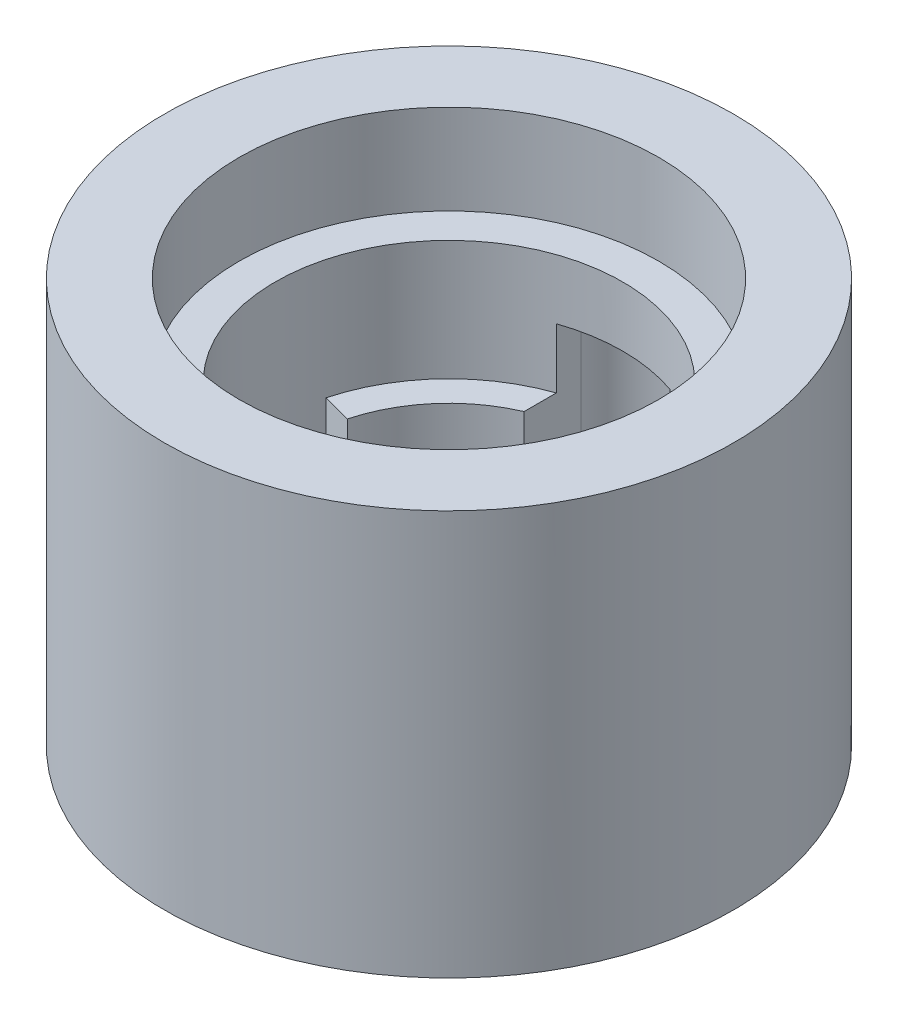
ISO-10303-21;
HEADER;
FILE_DESCRIPTION(('STEP AP214'),'2;1');
FILE_NAME('part.step','',(''),(''),'','','');
FILE_SCHEMA(('AUTOMOTIVE_DESIGN { 1 0 10303 214 1 1 1 1 }'));
ENDSEC;
DATA;
#1=APPLICATION_CONTEXT('core data for automotive mechanical design processes');
#2=APPLICATION_PROTOCOL_DEFINITION('international standard','automotive_design',2000,#1);
#3=PRODUCT_CONTEXT('',#1,'mechanical');
#4=PRODUCT('Part','Part','',(#3));
#5=PRODUCT_RELATED_PRODUCT_CATEGORY('part','',(#4));
#6=PRODUCT_DEFINITION_FORMATION('','',#4);
#7=PRODUCT_DEFINITION_CONTEXT('part definition',#1,'design');
#8=PRODUCT_DEFINITION('design','',#6,#7);
#9=PRODUCT_DEFINITION_SHAPE('','',#8);
#10=(LENGTH_UNIT() NAMED_UNIT(*) SI_UNIT(.MILLI.,.METRE.));
#11=(NAMED_UNIT(*) PLANE_ANGLE_UNIT() SI_UNIT($,.RADIAN.));
#12=(NAMED_UNIT(*) SI_UNIT($,.STERADIAN.) SOLID_ANGLE_UNIT());
#13=UNCERTAINTY_MEASURE_WITH_UNIT(LENGTH_MEASURE(1.E-05),#10,'distance_accuracy_value','');
#14=(GEOMETRIC_REPRESENTATION_CONTEXT(3) GLOBAL_UNCERTAINTY_ASSIGNED_CONTEXT((#13)) GLOBAL_UNIT_ASSIGNED_CONTEXT((#10,
#11,#12)) REPRESENTATION_CONTEXT('',''));
#15=CARTESIAN_POINT('',(0.,0.,0.));
#16=DIRECTION('',(0.,0.,1.));
#17=DIRECTION('',(1.,0.,0.));
#18=AXIS2_PLACEMENT_3D('',#15,#16,#17);
#19=CARTESIAN_POINT('',(0.,10.16,0.));
#20=DIRECTION('',(0.,-1.,0.));
#21=DIRECTION('',(0.,0.,-1.));
#22=AXIS2_PLACEMENT_3D('',#19,#20,#21);
#23=CYLINDRICAL_SURFACE('',#22,6.096);
#24=DIRECTION('',(0.,-1.,0.));
#25=VECTOR('',#24,1.);
#26=CARTESIAN_POINT('',(-5.88828383705816,10.16,1.57776089894497));
#27=LINE('',#26,#25);
#28=CARTESIAN_POINT('',(-5.88828383705816,5.08,1.57776089894497));
#29=VERTEX_POINT('',#28);
#30=CARTESIAN_POINT('',(-5.88828383705816,-3.175,1.57776089894497));
#31=VERTEX_POINT('',#30);
#32=EDGE_CURVE('E126',#29,#31,#27,.T.);
#33=ORIENTED_EDGE('',*,*,#32,.F.);
#34=CARTESIAN_POINT('',(0.,5.08,0.));
#35=DIRECTION('',(0.,1.,0.));
#36=DIRECTION('',(0.,0.,1.));
#37=AXIS2_PLACEMENT_3D('',#34,#35,#36);
#38=CIRCLE('',#37,6.096);
#39=CARTESIAN_POINT('',(2.413,5.08,-5.59809315749569));
#40=VERTEX_POINT('',#39);
#41=EDGE_CURVE('E152',#29,#40,#38,.T.);
#42=ORIENTED_EDGE('',*,*,#41,.T.);
#43=DIRECTION('',(0.,-1.,0.));
#44=VECTOR('',#43,1.);
#45=CARTESIAN_POINT('',(2.413,10.16,-5.59809315749568));
#46=LINE('',#45,#44);
#47=CARTESIAN_POINT('',(2.413,-3.175,-5.59809315749569));
#48=VERTEX_POINT('',#47);
#49=EDGE_CURVE('E197',#48,#40,#46,.F.);
#50=ORIENTED_EDGE('',*,*,#49,.F.);
#51=CARTESIAN_POINT('',(0.,-3.175,0.));
#52=DIRECTION('',(0.,-1.,0.));
#53=DIRECTION('',(0.,0.,1.));
#54=AXIS2_PLACEMENT_3D('',#51,#52,#53);
#55=CIRCLE('',#54,6.096);
#56=EDGE_CURVE('E171',#48,#31,#55,.T.);
#57=ORIENTED_EDGE('',*,*,#56,.T.);
#58=EDGE_LOOP('',(#33,#42,#50,#57));
#59=FACE_BOUND('',#58,.T.);
#60=ADVANCED_FACE('F38',(#59),#23,.F.);
#61=CARTESIAN_POINT('',(0.,5.08,0.));
#62=DIRECTION('',(0.,1.,0.));
#63=DIRECTION('',(0.,0.,1.));
#64=AXIS2_PLACEMENT_3D('',#61,#62,#63);
#65=PLANE('',#64);
#66=DIRECTION('',(0.965925826289068,0.,-0.258819045102522));
#67=VECTOR('',#66,1.);
#68=CARTESIAN_POINT('',(0.,5.08,0.));
#69=LINE('',#68,#67);
#70=CARTESIAN_POINT('',(-7.11500963644528,5.08,1.90646108622517));
#71=VERTEX_POINT('',#70);
#72=EDGE_CURVE('E143',#71,#29,#69,.T.);
#73=ORIENTED_EDGE('',*,*,#72,.F.);
#74=CARTESIAN_POINT('',(0.,5.08,0.));
#75=DIRECTION('',(0.,1.,0.));
#76=DIRECTION('',(0.,0.,1.));
#77=AXIS2_PLACEMENT_3D('',#74,#75,#76);
#78=CIRCLE('',#77,7.366);
#79=CARTESIAN_POINT('',(2.413,5.08,-6.95955364948069));
#80=VERTEX_POINT('',#79);
#81=EDGE_CURVE('E60',#71,#80,#78,.T.);
#82=ORIENTED_EDGE('',*,*,#81,.T.);
#83=DIRECTION('',(0.,0.,1.));
#84=VECTOR('',#83,1.);
#85=CARTESIAN_POINT('',(2.413,5.08,0.));
#86=LINE('',#85,#84);
#87=EDGE_CURVE('E220',#80,#40,#86,.T.);
#88=ORIENTED_EDGE('',*,*,#87,.T.);
#89=ORIENTED_EDGE('',*,*,#41,.F.);
#90=EDGE_LOOP('',(#73,#82,#88,#89));
#91=FACE_BOUND('',#90,.T.);
#92=ADVANCED_FACE('F256',(#91),#65,.T.);
#93=DIRECTION('',(0.,-1.,0.));
#94=VECTOR('',#93,1.);
#95=CARTESIAN_POINT('',(-5.88828383705816,10.16,-1.57776089894497));
#96=LINE('',#95,#94);
#97=CARTESIAN_POINT('',(-5.88828383705816,-3.175,-1.57776089894497));
#98=VERTEX_POINT('',#97);
#99=CARTESIAN_POINT('',(-5.88828383705816,5.08,-1.57776089894497));
#100=VERTEX_POINT('',#99);
#101=EDGE_CURVE('E52',#98,#100,#96,.F.);
#102=ORIENTED_EDGE('',*,*,#101,.F.);
#103=CARTESIAN_POINT('',(-2.413,-3.175,-5.59809315749569));
#104=VERTEX_POINT('',#103);
#105=EDGE_CURVE('E170',#98,#104,#55,.T.);
#106=ORIENTED_EDGE('',*,*,#105,.T.);
#107=DIRECTION('',(0.,-1.,0.));
#108=VECTOR('',#107,1.);
#109=CARTESIAN_POINT('',(-2.413,10.16,-5.59809315749569));
#110=LINE('',#109,#108);
#111=CARTESIAN_POINT('',(-2.413,5.08,-5.59809315749569));
#112=VERTEX_POINT('',#111);
#113=EDGE_CURVE('E208',#112,#104,#110,.T.);
#114=ORIENTED_EDGE('',*,*,#113,.F.);
#115=EDGE_CURVE('E153',#112,#100,#38,.T.);
#116=ORIENTED_EDGE('',*,*,#115,.T.);
#117=EDGE_LOOP('',(#102,#106,#114,#116));
#118=FACE_BOUND('',#117,.T.);
#119=ADVANCED_FACE('F40',(#118),#23,.F.);
#120=CARTESIAN_POINT('',(2.413,19.5037827992735,-8.001));
#121=DIRECTION('',(0.,0.,-1.));
#122=DIRECTION('',(-1.,0.,0.));
#123=AXIS2_PLACEMENT_3D('',#120,#121,#122);
#124=PLANE('',#123);
#125=DIRECTION('',(-1.,0.,0.));
#126=VECTOR('',#125,1.);
#127=CARTESIAN_POINT('',(2.413,2.54,-8.001));
#128=LINE('',#127,#126);
#129=CARTESIAN_POINT('',(2.413,2.54,-8.001));
#130=VERTEX_POINT('',#129);
#131=CARTESIAN_POINT('',(-2.413,2.54,-8.001));
#132=VERTEX_POINT('',#131);
#133=EDGE_CURVE('E188',#130,#132,#128,.T.);
#134=ORIENTED_EDGE('',*,*,#133,.T.);
#135=DIRECTION('',(0.,-1.,0.));
#136=VECTOR('',#135,1.);
#137=CARTESIAN_POINT('',(-2.413,19.5037827992735,-8.001));
#138=LINE('',#137,#136);
#139=CARTESIAN_POINT('',(-2.413,-3.175,-8.001));
#140=VERTEX_POINT('',#139);
#141=EDGE_CURVE('E200',#132,#140,#138,.T.);
#142=ORIENTED_EDGE('',*,*,#141,.T.);
#143=DIRECTION('',(1.,0.,0.));
#144=VECTOR('',#143,1.);
#145=CARTESIAN_POINT('',(2.413,-3.175,-8.001));
#146=LINE('',#145,#144);
#147=CARTESIAN_POINT('',(2.413,-3.175,-8.001));
#148=VERTEX_POINT('',#147);
#149=EDGE_CURVE('E176',#140,#148,#146,.T.);
#150=ORIENTED_EDGE('',*,*,#149,.T.);
#151=DIRECTION('',(0.,-1.,0.));
#152=VECTOR('',#151,1.);
#153=CARTESIAN_POINT('',(2.413,19.5037827992735,-8.001));
#154=LINE('',#153,#152);
#155=EDGE_CURVE('E203',#130,#148,#154,.T.);
#156=ORIENTED_EDGE('',*,*,#155,.F.);
#157=EDGE_LOOP('',(#134,#142,#150,#156));
#158=FACE_BOUND('',#157,.T.);
#159=ADVANCED_FACE('F240',(#158),#124,.F.);
#160=CARTESIAN_POINT('',(0.,10.16,0.));
#161=DIRECTION('',(0.,1.,0.));
#162=DIRECTION('',(0.,0.,1.));
#163=AXIS2_PLACEMENT_3D('',#160,#161,#162);
#164=PLANE('',#163);
#165=CARTESIAN_POINT('',(0.,10.16,0.));
#166=DIRECTION('',(0.,1.,0.));
#167=DIRECTION('',(0.,0.,1.));
#168=AXIS2_PLACEMENT_3D('',#165,#166,#167);
#169=CIRCLE('',#168,7.366);
#170=CARTESIAN_POINT('',(0.,10.16,7.366));
#171=VERTEX_POINT('',#170);
#172=EDGE_CURVE('E156',#171,#171,#169,.T.);
#173=ORIENTED_EDGE('',*,*,#172,.F.);
#174=EDGE_LOOP('',(#173));
#175=FACE_BOUND('',#174,.T.);
#176=CARTESIAN_POINT('',(0.,10.16,0.));
#177=DIRECTION('',(0.,1.,0.));
#178=DIRECTION('',(0.,0.,1.));
#179=AXIS2_PLACEMENT_3D('',#176,#177,#178);
#180=CIRCLE('',#179,8.89);
#181=CARTESIAN_POINT('',(0.,10.16,8.89));
#182=VERTEX_POINT('',#181);
#183=EDGE_CURVE('E212',#182,#182,#180,.F.);
#184=ORIENTED_EDGE('',*,*,#183,.F.);
#185=EDGE_LOOP('',(#184));
#186=FACE_BOUND('',#185,.T.);
#187=ADVANCED_FACE('F269',(#175,#186),#164,.T.);
#188=CARTESIAN_POINT('',(0.,12.7,0.));
#189=DIRECTION('',(0.,-1.,0.));
#190=DIRECTION('',(0.,0.,-1.));
#191=AXIS2_PLACEMENT_3D('',#188,#189,#190);
#192=CYLINDRICAL_SURFACE('',#191,12.065);
#193=CARTESIAN_POINT('',(0.,13.97,0.));
#194=DIRECTION('',(0.,1.,0.));
#195=DIRECTION('',(0.,0.,1.));
#196=AXIS2_PLACEMENT_3D('',#193,#194,#195);
#197=CIRCLE('',#196,12.065);
#198=CARTESIAN_POINT('',(0.,13.97,12.065));
#199=VERTEX_POINT('',#198);
#200=EDGE_CURVE('E215',#199,#199,#197,.T.);
#201=ORIENTED_EDGE('',*,*,#200,.F.);
#202=EDGE_LOOP('',(#201));
#203=FACE_BOUND('',#202,.T.);
#204=CARTESIAN_POINT('',(0.,-3.175,0.));
#205=DIRECTION('',(0.,-1.,0.));
#206=DIRECTION('',(0.,0.,-1.));
#207=AXIS2_PLACEMENT_3D('',#204,#205,#206);
#208=CIRCLE('',#207,12.065);
#209=CARTESIAN_POINT('',(0.,-3.175,-12.065));
#210=VERTEX_POINT('',#209);
#211=EDGE_CURVE('E182',#210,#210,#208,.T.);
#212=ORIENTED_EDGE('',*,*,#211,.F.);
#213=EDGE_LOOP('',(#212));
#214=FACE_BOUND('',#213,.T.);
#215=ADVANCED_FACE('F293',(#203,#214),#192,.T.);
#216=CARTESIAN_POINT('',(0.,13.97,0.));
#217=DIRECTION('',(0.,1.,0.));
#218=DIRECTION('',(0.,0.,1.));
#219=AXIS2_PLACEMENT_3D('',#216,#217,#218);
#220=PLANE('',#219);
#221=CARTESIAN_POINT('',(0.,13.97,0.));
#222=DIRECTION('',(0.,1.,0.));
#223=DIRECTION('',(0.,0.,1.));
#224=AXIS2_PLACEMENT_3D('',#221,#222,#223);
#225=CIRCLE('',#224,8.89);
#226=CARTESIAN_POINT('',(0.,13.97,8.89));
#227=VERTEX_POINT('',#226);
#228=EDGE_CURVE('E211',#227,#227,#225,.T.);
#229=ORIENTED_EDGE('',*,*,#228,.F.);
#230=EDGE_LOOP('',(#229));
#231=FACE_BOUND('',#230,.T.);
#232=ORIENTED_EDGE('',*,*,#200,.T.);
#233=EDGE_LOOP('',(#232));
#234=FACE_BOUND('',#233,.T.);
#235=ADVANCED_FACE('F299',(#231,#234),#220,.T.);
#236=CARTESIAN_POINT('',(0.,-14.9847171389936,0.));
#237=DIRECTION('',(0.,1.,0.));
#238=DIRECTION('',(0.,0.,1.));
#239=AXIS2_PLACEMENT_3D('',#236,#237,#238);
#240=CYLINDRICAL_SURFACE('',#239,8.89);
#241=ORIENTED_EDGE('',*,*,#183,.T.);
#242=EDGE_LOOP('',(#241));
#243=FACE_BOUND('',#242,.T.);
#244=ORIENTED_EDGE('',*,*,#228,.T.);
#245=EDGE_LOOP('',(#244));
#246=FACE_BOUND('',#245,.T.);
#247=ADVANCED_FACE('F296',(#243,#246),#240,.F.);
#248=CARTESIAN_POINT('',(0.,7.62,0.));
#249=DIRECTION('',(0.,1.,0.));
#250=DIRECTION('',(0.,0.,1.));
#251=AXIS2_PLACEMENT_3D('',#248,#249,#250);
#252=PLANE('',#251);
#253=DIRECTION('',(0.,0.,1.));
#254=VECTOR('',#253,1.);
#255=CARTESIAN_POINT('',(2.413,7.62,0.));
#256=LINE('',#255,#254);
#257=CARTESIAN_POINT('',(2.413,7.62,-8.001));
#258=VERTEX_POINT('',#257);
#259=CARTESIAN_POINT('',(2.413,7.62,-6.95955364948069));
#260=VERTEX_POINT('',#259);
#261=EDGE_CURVE('E194',#258,#260,#256,.T.);
#262=ORIENTED_EDGE('',*,*,#261,.T.);
#263=CARTESIAN_POINT('',(0.,7.62,0.));
#264=DIRECTION('',(0.,1.,0.));
#265=DIRECTION('',(0.,0.,1.));
#266=AXIS2_PLACEMENT_3D('',#263,#264,#265);
#267=CIRCLE('',#266,7.366);
#268=CARTESIAN_POINT('',(-2.413,7.62,-6.95955364948069));
#269=VERTEX_POINT('',#268);
#270=EDGE_CURVE('E164',#260,#269,#267,.T.);
#271=ORIENTED_EDGE('',*,*,#270,.T.);
#272=DIRECTION('',(0.,0.,-1.));
#273=VECTOR('',#272,1.);
#274=CARTESIAN_POINT('',(-2.413,7.62,0.));
#275=LINE('',#274,#273);
#276=CARTESIAN_POINT('',(-2.413,7.62,-8.001));
#277=VERTEX_POINT('',#276);
#278=EDGE_CURVE('E191',#269,#277,#275,.T.);
#279=ORIENTED_EDGE('',*,*,#278,.T.);
#280=CARTESIAN_POINT('',(0.,7.62,-7.58428125));
#281=DIRECTION('',(0.,-1.,0.));
#282=DIRECTION('',(0.,0.,1.));
#283=AXIS2_PLACEMENT_3D('',#280,#281,#282);
#284=CIRCLE('',#283,2.44871875);
#285=EDGE_CURVE('E185',#277,#258,#284,.T.);
#286=ORIENTED_EDGE('',*,*,#285,.T.);
#287=EDGE_LOOP('',(#262,#271,#279,#286));
#288=FACE_BOUND('',#287,.T.);
#289=ADVANCED_FACE('F227',(#288),#252,.F.);
#290=CARTESIAN_POINT('',(-2.413,19.5037827992735,0.));
#291=DIRECTION('',(-1.,0.,0.));
#292=DIRECTION('',(0.,0.,1.));
#293=AXIS2_PLACEMENT_3D('',#290,#291,#292);
#294=PLANE('',#293);
#295=ORIENTED_EDGE('',*,*,#278,.F.);
#296=DIRECTION('',(0.,1.,0.));
#297=VECTOR('',#296,1.);
#298=CARTESIAN_POINT('',(-2.413,5.08,-6.95955364948069));
#299=LINE('',#298,#297);
#300=CARTESIAN_POINT('',(-2.413,5.08,-6.95955364948069));
#301=VERTEX_POINT('',#300);
#302=EDGE_CURVE('E167',#269,#301,#299,.F.);
#303=ORIENTED_EDGE('',*,*,#302,.T.);
#304=DIRECTION('',(0.,0.,-1.));
#305=VECTOR('',#304,1.);
#306=CARTESIAN_POINT('',(-2.413,5.08,0.));
#307=LINE('',#306,#305);
#308=EDGE_CURVE('E160',#112,#301,#307,.T.);
#309=ORIENTED_EDGE('',*,*,#308,.F.);
#310=ORIENTED_EDGE('',*,*,#113,.T.);
#311=DIRECTION('',(0.,0.,-1.));
#312=VECTOR('',#311,1.);
#313=CARTESIAN_POINT('',(-2.413,-3.175,-8.001));
#314=LINE('',#313,#312);
#315=EDGE_CURVE('E173',#104,#140,#314,.T.);
#316=ORIENTED_EDGE('',*,*,#315,.T.);
#317=ORIENTED_EDGE('',*,*,#141,.F.);
#318=EDGE_CURVE('E204',#277,#132,#138,.T.);
#319=ORIENTED_EDGE('',*,*,#318,.F.);
#320=EDGE_LOOP('',(#295,#303,#309,#310,#316,#317,#319));
#321=FACE_BOUND('',#320,.T.);
#322=ADVANCED_FACE('F236',(#321),#294,.F.);
#323=CARTESIAN_POINT('',(2.413,19.5037827992735,0.));
#324=DIRECTION('',(1.,0.,0.));
#325=DIRECTION('',(0.,0.,-1.));
#326=AXIS2_PLACEMENT_3D('',#323,#324,#325);
#327=PLANE('',#326);
#328=ORIENTED_EDGE('',*,*,#87,.F.);
#329=DIRECTION('',(0.,1.,0.));
#330=VECTOR('',#329,1.);
#331=CARTESIAN_POINT('',(2.413,5.08,-6.95955364948069));
#332=LINE('',#331,#330);
#333=EDGE_CURVE('E46',#80,#260,#332,.T.);
#334=ORIENTED_EDGE('',*,*,#333,.T.);
#335=ORIENTED_EDGE('',*,*,#261,.F.);
#336=EDGE_CURVE('E198',#258,#130,#154,.T.);
#337=ORIENTED_EDGE('',*,*,#336,.T.);
#338=ORIENTED_EDGE('',*,*,#155,.T.);
#339=DIRECTION('',(0.,0.,1.));
#340=VECTOR('',#339,1.);
#341=CARTESIAN_POINT('',(2.413,-3.175,-5.59809315749569));
#342=LINE('',#341,#340);
#343=EDGE_CURVE('E179',#148,#48,#342,.T.);
#344=ORIENTED_EDGE('',*,*,#343,.T.);
#345=ORIENTED_EDGE('',*,*,#49,.T.);
#346=EDGE_LOOP('',(#328,#334,#335,#337,#338,#344,#345));
#347=FACE_BOUND('',#346,.T.);
#348=ADVANCED_FACE('F225',(#347),#327,.F.);
#349=CARTESIAN_POINT('',(0.,2.54,-7.58428125));
#350=DIRECTION('',(0.,1.,0.));
#351=DIRECTION('',(0.,0.,1.));
#352=AXIS2_PLACEMENT_3D('',#349,#350,#351);
#353=CYLINDRICAL_SURFACE('',#352,2.44871875);
#354=ORIENTED_EDGE('',*,*,#285,.F.);
#355=ORIENTED_EDGE('',*,*,#318,.T.);
#356=CARTESIAN_POINT('',(0.,2.54,-7.58428125));
#357=DIRECTION('',(0.,-1.,0.));
#358=DIRECTION('',(0.,0.,1.));
#359=AXIS2_PLACEMENT_3D('',#356,#357,#358);
#360=CIRCLE('',#359,2.44871875);
#361=EDGE_CURVE('E186',#132,#130,#360,.T.);
#362=ORIENTED_EDGE('',*,*,#361,.T.);
#363=ORIENTED_EDGE('',*,*,#336,.F.);
#364=EDGE_LOOP('',(#354,#355,#362,#363));
#365=FACE_BOUND('',#364,.T.);
#366=ADVANCED_FACE('F232',(#365),#353,.F.);
#367=CARTESIAN_POINT('',(0.,2.54,-7.58428125));
#368=DIRECTION('',(0.,1.,0.));
#369=DIRECTION('',(0.,0.,1.));
#370=AXIS2_PLACEMENT_3D('',#367,#368,#369);
#371=PLANE('',#370);
#372=ORIENTED_EDGE('',*,*,#361,.F.);
#373=ORIENTED_EDGE('',*,*,#133,.F.);
#374=EDGE_LOOP('',(#372,#373));
#375=FACE_BOUND('',#374,.T.);
#376=ADVANCED_FACE('F245',(#375),#371,.T.);
#377=CARTESIAN_POINT('',(0.,-3.175,0.));
#378=DIRECTION('',(0.,-1.,0.));
#379=DIRECTION('',(0.,0.,-1.));
#380=AXIS2_PLACEMENT_3D('',#377,#378,#379);
#381=PLANE('',#380);
#382=DIRECTION('',(0.965925826289068,0.,-0.258819045102522));
#383=VECTOR('',#382,1.);
#384=CARTESIAN_POINT('',(0.,-3.175,0.));
#385=LINE('',#384,#383);
#386=CARTESIAN_POINT('',(-7.11500963644528,-3.175,1.90646108622517));
#387=VERTEX_POINT('',#386);
#388=EDGE_CURVE('E121',#387,#31,#385,.T.);
#389=ORIENTED_EDGE('',*,*,#388,.T.);
#390=ORIENTED_EDGE('',*,*,#56,.F.);
#391=ORIENTED_EDGE('',*,*,#343,.F.);
#392=ORIENTED_EDGE('',*,*,#149,.F.);
#393=ORIENTED_EDGE('',*,*,#315,.F.);
#394=ORIENTED_EDGE('',*,*,#105,.F.);
#395=DIRECTION('',(-0.965925826289068,0.,-0.258819045102521));
#396=VECTOR('',#395,1.);
#397=CARTESIAN_POINT('',(0.,-3.175,0.));
#398=LINE('',#397,#396);
#399=CARTESIAN_POINT('',(-7.11500963644528,-3.175,-1.90646108622517));
#400=VERTEX_POINT('',#399);
#401=EDGE_CURVE('E131',#98,#400,#398,.T.);
#402=ORIENTED_EDGE('',*,*,#401,.T.);
#403=CARTESIAN_POINT('',(0.,-3.175,0.));
#404=DIRECTION('',(0.,-1.,0.));
#405=DIRECTION('',(0.,0.,-1.));
#406=AXIS2_PLACEMENT_3D('',#403,#404,#405);
#407=CIRCLE('',#406,7.366);
#408=EDGE_CURVE('E136',#400,#387,#407,.F.);
#409=ORIENTED_EDGE('',*,*,#408,.T.);
#410=EDGE_LOOP('',(#389,#390,#391,#392,#393,#394,#402,#409));
#411=FACE_BOUND('',#410,.T.);
#412=ORIENTED_EDGE('',*,*,#211,.T.);
#413=EDGE_LOOP('',(#412));
#414=FACE_BOUND('',#413,.T.);
#415=ADVANCED_FACE('F140',(#411,#414),#381,.T.);
#416=CARTESIAN_POINT('',(0.,5.08,0.));
#417=DIRECTION('',(0.,1.,0.));
#418=DIRECTION('',(0.,0.,1.));
#419=AXIS2_PLACEMENT_3D('',#416,#417,#418);
#420=CYLINDRICAL_SURFACE('',#419,7.366);
#421=ORIENTED_EDGE('',*,*,#172,.T.);
#422=EDGE_LOOP('',(#421));
#423=FACE_BOUND('',#422,.T.);
#424=ORIENTED_EDGE('',*,*,#270,.F.);
#425=ORIENTED_EDGE('',*,*,#333,.F.);
#426=ORIENTED_EDGE('',*,*,#81,.F.);
#427=DIRECTION('',(0.,1.,0.));
#428=VECTOR('',#427,1.);
#429=CARTESIAN_POINT('',(-7.11500963644528,-11.4693553994969,1.90646108622517));
#430=LINE('',#429,#428);
#431=EDGE_CURVE('E124',#387,#71,#430,.T.);
#432=ORIENTED_EDGE('',*,*,#431,.F.);
#433=ORIENTED_EDGE('',*,*,#408,.F.);
#434=DIRECTION('',(0.,1.,0.));
#435=VECTOR('',#434,1.);
#436=CARTESIAN_POINT('',(-7.11500963644528,-11.4693553994969,-1.90646108622517));
#437=LINE('',#436,#435);
#438=CARTESIAN_POINT('',(-7.11500963644528,5.08,-1.90646108622517));
#439=VERTEX_POINT('',#438);
#440=EDGE_CURVE('E147',#400,#439,#437,.T.);
#441=ORIENTED_EDGE('',*,*,#440,.T.);
#442=EDGE_CURVE('E157',#301,#439,#78,.T.);
#443=ORIENTED_EDGE('',*,*,#442,.F.);
#444=ORIENTED_EDGE('',*,*,#302,.F.);
#445=EDGE_LOOP('',(#424,#425,#426,#432,#433,#441,#443,#444));
#446=FACE_BOUND('',#445,.T.);
#447=ADVANCED_FACE('F134',(#423,#446),#420,.F.);
#448=DIRECTION('',(-0.965925826289068,0.,-0.258819045102521));
#449=VECTOR('',#448,1.);
#450=CARTESIAN_POINT('',(0.,5.08,0.));
#451=LINE('',#450,#449);
#452=EDGE_CURVE('E12',#100,#439,#451,.T.);
#453=ORIENTED_EDGE('',*,*,#452,.F.);
#454=ORIENTED_EDGE('',*,*,#115,.F.);
#455=ORIENTED_EDGE('',*,*,#308,.T.);
#456=ORIENTED_EDGE('',*,*,#442,.T.);
#457=EDGE_LOOP('',(#453,#454,#455,#456));
#458=FACE_BOUND('',#457,.T.);
#459=ADVANCED_FACE('F263',(#458),#65,.T.);
#460=CARTESIAN_POINT('',(0.,-11.4693553994969,0.));
#461=DIRECTION('',(0.258819045102522,0.,0.965925826289068));
#462=DIRECTION('',(0.965925826289068,0.,-0.258819045102522));
#463=AXIS2_PLACEMENT_3D('',#460,#461,#462);
#464=PLANE('',#463);
#465=ORIENTED_EDGE('',*,*,#32,.T.);
#466=ORIENTED_EDGE('',*,*,#388,.F.);
#467=ORIENTED_EDGE('',*,*,#431,.T.);
#468=ORIENTED_EDGE('',*,*,#72,.T.);
#469=EDGE_LOOP('',(#465,#466,#467,#468));
#470=FACE_BOUND('',#469,.T.);
#471=ADVANCED_FACE('F123',(#470),#464,.F.);
#472=CARTESIAN_POINT('',(0.,-11.4693553994969,0.));
#473=DIRECTION('',(0.258819045102521,0.,-0.965925826289068));
#474=DIRECTION('',(-0.965925826289068,0.,-0.258819045102521));
#475=AXIS2_PLACEMENT_3D('',#472,#473,#474);
#476=PLANE('',#475);
#477=ORIENTED_EDGE('',*,*,#101,.T.);
#478=ORIENTED_EDGE('',*,*,#452,.T.);
#479=ORIENTED_EDGE('',*,*,#440,.F.);
#480=ORIENTED_EDGE('',*,*,#401,.F.);
#481=EDGE_LOOP('',(#477,#478,#479,#480));
#482=FACE_BOUND('',#481,.T.);
#483=ADVANCED_FACE('F276',(#482),#476,.F.);
#484=CLOSED_SHELL('',(#60,#92,#119,#159,#187,#215,#235,#247,#289,#322,#348,#366,#376,#415,#447,
#459,#471,#483));
#485=MANIFOLD_SOLID_BREP('B2',#484);
#486=ADVANCED_BREP_SHAPE_REPRESENTATION('',(#18,#485),#14);
#487=SHAPE_DEFINITION_REPRESENTATION(#9,#486);
ENDSEC;
END-ISO-10303-21;
